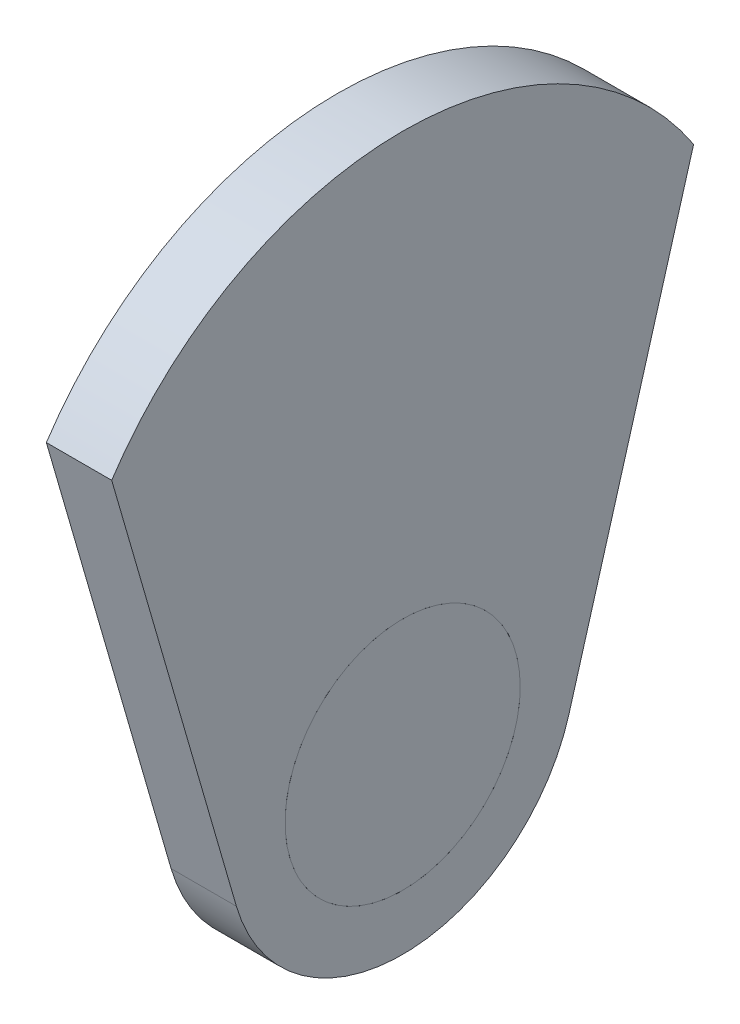
ISO-10303-21;
HEADER;
FILE_DESCRIPTION(('STEP AP214'),'2;1');
FILE_NAME('part.step','',(''),(''),'','','');
FILE_SCHEMA(('AUTOMOTIVE_DESIGN { 1 0 10303 214 1 1 1 1 }'));
ENDSEC;
DATA;
#1=APPLICATION_CONTEXT('core data for automotive mechanical design processes');
#2=APPLICATION_PROTOCOL_DEFINITION('international standard','automotive_design',2000,#1);
#3=PRODUCT_CONTEXT('',#1,'mechanical');
#4=PRODUCT('Part','Part','',(#3));
#5=PRODUCT_RELATED_PRODUCT_CATEGORY('part','',(#4));
#6=PRODUCT_DEFINITION_FORMATION('','',#4);
#7=PRODUCT_DEFINITION_CONTEXT('part definition',#1,'design');
#8=PRODUCT_DEFINITION('design','',#6,#7);
#9=PRODUCT_DEFINITION_SHAPE('','',#8);
#10=(LENGTH_UNIT() NAMED_UNIT(*) SI_UNIT(.MILLI.,.METRE.));
#11=(NAMED_UNIT(*) PLANE_ANGLE_UNIT() SI_UNIT($,.RADIAN.));
#12=(NAMED_UNIT(*) SI_UNIT($,.STERADIAN.) SOLID_ANGLE_UNIT());
#13=UNCERTAINTY_MEASURE_WITH_UNIT(LENGTH_MEASURE(1.E-05),#10,'distance_accuracy_value','');
#14=(GEOMETRIC_REPRESENTATION_CONTEXT(3) GLOBAL_UNCERTAINTY_ASSIGNED_CONTEXT((#13)) GLOBAL_UNIT_ASSIGNED_CONTEXT((#10,
#11,#12)) REPRESENTATION_CONTEXT('',''));
#15=CARTESIAN_POINT('',(0.,0.,0.));
#16=DIRECTION('',(0.,0.,1.));
#17=DIRECTION('',(1.,0.,0.));
#18=AXIS2_PLACEMENT_3D('',#15,#16,#17);
#19=CARTESIAN_POINT('',(15.,0.,0.));
#20=DIRECTION('',(1.,0.,0.));
#21=DIRECTION('',(0.,0.,-1.));
#22=AXIS2_PLACEMENT_3D('',#19,#20,#21);
#23=PLANE('',#22);
#24=CARTESIAN_POINT('',(15.,0.,0.));
#25=DIRECTION('',(1.,0.,0.));
#26=DIRECTION('',(0.,0.,-1.));
#27=AXIS2_PLACEMENT_3D('',#24,#25,#26);
#28=CIRCLE('',#27,27.);
#29=CARTESIAN_POINT('',(15.,6.550179231476,-26.1934181052329));
#30=VERTEX_POINT('',#29);
#31=EDGE_CURVE('E12',#30,#30,#28,.T.);
#32=ORIENTED_EDGE('',*,*,#31,.T.);
#33=EDGE_LOOP('',(#32));
#34=FACE_BOUND('',#33,.T.);
#35=ADVANCED_FACE('F48',(#34),#23,.T.);
#36=CARTESIAN_POINT('',(0.,0.,0.));
#37=DIRECTION('',(1.,0.,0.));
#38=DIRECTION('',(0.,0.,-1.));
#39=AXIS2_PLACEMENT_3D('',#36,#37,#38);
#40=PLANE('',#39);
#41=CARTESIAN_POINT('',(0.,0.,0.));
#42=DIRECTION('',(1.,0.,0.));
#43=DIRECTION('',(0.,0.,-1.));
#44=AXIS2_PLACEMENT_3D('',#41,#42,#43);
#45=CIRCLE('',#44,27.);
#46=CARTESIAN_POINT('',(0.,22.4355320231998,15.0215479507265));
#47=VERTEX_POINT('',#46);
#48=EDGE_CURVE('E54',#47,#47,#45,.T.);
#49=ORIENTED_EDGE('',*,*,#48,.F.);
#50=EDGE_LOOP('',(#49));
#51=FACE_BOUND('',#50,.T.);
#52=ADVANCED_FACE('F63',(#51),#40,.F.);
#53=CARTESIAN_POINT('',(0.,22.4355320231998,15.0215479507265));
#54=CARTESIAN_POINT('',(15.,6.550179231476,-26.1934181052329));
#55=CARTESIAN_POINT('',(0.,-7.60756387825323,59.8926119971261));
#56=CARTESIAN_POINT('',(15.,58.9370154419417,-13.0930596422809));
#57=CARTESIAN_POINT('',(0.,-52.4786279246528,29.8495160956731));
#58=CARTESIAN_POINT('',(15.,45.8366569789897,39.2937765681848));
#59=CARTESIAN_POINT('',(0.,-22.4355320231998,-15.0215479507265));
#60=CARTESIAN_POINT('',(15.,-6.55017923147599,26.1934181052329));
#61=CARTESIAN_POINT('',(0.,7.6075638782532,-59.8926119971261));
#62=CARTESIAN_POINT('',(15.,-58.9370154419417,13.0930596422809));
#63=CARTESIAN_POINT('',(0.,52.4786279246528,-29.8495160956731));
#64=CARTESIAN_POINT('',(15.,-45.8366569789897,-39.2937765681848));
#65=CARTESIAN_POINT('',(0.,22.4355320231998,15.0215479507265));
#66=CARTESIAN_POINT('',(15.,6.550179231476,-26.1934181052329));
#67=(BOUNDED_SURFACE() B_SPLINE_SURFACE(3,1,((#53,#54),(#55,#56),(#57,#58),(#59,#60),(#61,#62),
(#63,#64),(#65,#66)),.UNSPECIFIED.,.T.,.F.,.F.) B_SPLINE_SURFACE_WITH_KNOTS((4,3,4),(2,2),(0.,
0.5,1.),(0.,1.),.UNSPECIFIED.) GEOMETRIC_REPRESENTATION_ITEM() RATIONAL_B_SPLINE_SURFACE(((1.,
1.),(0.333333333333334,0.333333333333333),(0.333333333333334,0.333333333333333),(1.,1.),
(0.333333333333333,0.333333333333333),(0.333333333333333,0.333333333333333),(1.,1.))) REPRESENTATION_ITEM('') SURFACE());
#68=CARTESIAN_POINT('',(0.,22.4355320231998,15.0215479507265));
#69=CARTESIAN_POINT('',(0.15625,22.270059598286,14.5922253876436));
#70=CARTESIAN_POINT('',(0.3125,22.1045871733722,14.1629028245607));
#71=CARTESIAN_POINT('',(0.625,21.7736423235446,13.3042576983949));
#72=CARTESIAN_POINT('',(0.78125,21.6081698986308,12.874935135312));
#73=CARTESIAN_POINT('',(1.09375,21.2772250488033,12.0162900091462));
#74=CARTESIAN_POINT('',(1.25,21.1117526238895,11.5869674460632));
#75=CARTESIAN_POINT('',(1.5625,20.7808077740619,10.7283223198974));
#76=CARTESIAN_POINT('',(1.71875,20.6153353491481,10.2989997568145));
#77=CARTESIAN_POINT('',(2.03125,20.2843904993205,9.4403546306487));
#78=CARTESIAN_POINT('',(2.1875,20.1189180744067,9.01103206756578));
#79=CARTESIAN_POINT('',(2.5,19.7879732245792,8.15238694139996));
#80=CARTESIAN_POINT('',(2.65625,19.6225007996654,7.72306437831706));
#81=CARTESIAN_POINT('',(2.96875,19.2915559498378,6.86441925215123));
#82=CARTESIAN_POINT('',(3.125,19.126083524924,6.43509668906832));
#83=CARTESIAN_POINT('',(3.4375,18.7951386750964,5.5764515629025));
#84=CARTESIAN_POINT('',(3.59375,18.6296662501826,5.14712899981959));
#85=CARTESIAN_POINT('',(3.90625,18.2987214003551,4.28848387365377));
#86=CARTESIAN_POINT('',(4.0625,18.1332489754413,3.85916131057086));
#87=CARTESIAN_POINT('',(4.375,17.8023041256137,3.00051618440504));
#88=CARTESIAN_POINT('',(4.53125,17.6368317006999,2.57119362132213));
#89=CARTESIAN_POINT('',(4.84375,17.3058868508723,1.71254849515631));
#90=CARTESIAN_POINT('',(5.,17.1404144259585,1.2832259320734));
#91=CARTESIAN_POINT('',(5.3125,16.809469576131,0.42458080590758));
#92=CARTESIAN_POINT('',(5.46875,16.6439971512172,-0.00474175717532954));
#93=CARTESIAN_POINT('',(5.78125,16.3130523013896,-0.86338688334115));
#94=CARTESIAN_POINT('',(5.9375,16.1475798764758,-1.29270944642406));
#95=CARTESIAN_POINT('',(6.25,15.8166350266482,-2.15135457258988));
#96=CARTESIAN_POINT('',(6.40625,15.6511626017344,-2.58067713567279));
#97=CARTESIAN_POINT('',(6.71875,15.3202177519068,-3.43932226183861));
#98=CARTESIAN_POINT('',(6.875,15.1547453269931,-3.86864482492152));
#99=CARTESIAN_POINT('',(7.1875,14.8238004771655,-4.72728995108734));
#100=CARTESIAN_POINT('',(7.34375,14.6583280522517,-5.15661251417025));
#101=CARTESIAN_POINT('',(7.65625,14.3273832024241,-6.01525764033607));
#102=CARTESIAN_POINT('',(7.8125,14.1619107775103,-6.44458020341898));
#103=CARTESIAN_POINT('',(8.125,13.8309659276827,-7.3032253295848));
#104=CARTESIAN_POINT('',(8.28125,13.6654935027689,-7.73254789266771));
#105=CARTESIAN_POINT('',(8.59375,13.3345486529414,-8.59119301883354));
#106=CARTESIAN_POINT('',(8.75,13.1690762280276,-9.02051558191645));
#107=CARTESIAN_POINT('',(9.0625,12.8381313782,-9.87916070808227));
#108=CARTESIAN_POINT('',(9.21875,12.6726589532862,-10.3084832711652));
#109=CARTESIAN_POINT('',(9.53125,12.3417141034586,-11.167128397331));
#110=CARTESIAN_POINT('',(9.6875,12.1762416785448,-11.5964509604139));
#111=CARTESIAN_POINT('',(10.,11.8452968287173,-12.4550960865797));
#112=CARTESIAN_POINT('',(10.15625,11.6798244038035,-12.8844186496626));
#113=CARTESIAN_POINT('',(10.46875,11.3488795539759,-13.7430637758285));
#114=CARTESIAN_POINT('',(10.625,11.1834071290621,-14.1723863389114));
#115=CARTESIAN_POINT('',(10.9375,10.8524622792345,-15.0310314650772));
#116=CARTESIAN_POINT('',(11.09375,10.6869898543207,-15.4603540281601));
#117=CARTESIAN_POINT('',(11.40625,10.3560450044932,-16.3189991543259));
#118=CARTESIAN_POINT('',(11.5625,10.1905725795794,-16.7483217174088));
#119=CARTESIAN_POINT('',(11.875,9.85962772975179,-17.6069668435747));
#120=CARTESIAN_POINT('',(12.03125,9.694155304838,-18.0362894066576));
#121=CARTESIAN_POINT('',(12.34375,9.36321045501042,-18.8949345328234));
#122=CARTESIAN_POINT('',(12.5,9.19773803009663,-19.3242570959063));
#123=CARTESIAN_POINT('',(12.8125,8.86679318026905,-20.1829022220721));
#124=CARTESIAN_POINT('',(12.96875,8.70132075535527,-20.612224785155));
#125=CARTESIAN_POINT('',(13.28125,8.37037590552769,-21.4708699113208));
#126=CARTESIAN_POINT('',(13.4375,8.2049034806139,-21.9001924744038));
#127=CARTESIAN_POINT('',(13.75,7.87395863078632,-22.7588376005696));
#128=CARTESIAN_POINT('',(13.90625,7.70848620587253,-23.1881601636525));
#129=CARTESIAN_POINT('',(14.21875,7.37754135604495,-24.0468052898183));
#130=CARTESIAN_POINT('',(14.375,7.21206893113116,-24.4761278529012));
#131=CARTESIAN_POINT('',(14.6875,6.88112408130358,-25.334772979067));
#132=CARTESIAN_POINT('',(14.84375,6.71565165638979,-25.7640955421499));
#133=CARTESIAN_POINT('',(15.,6.550179231476,-26.1934181052329));
#134=B_SPLINE_CURVE_WITH_KNOTS('',3,(#68,#69,#70,#71,#72,#73,#74,#75,#76,#77,#78,#79,#80,#81,
#82,#83,#84,#85,#86,#87,#88,#89,#90,#91,#92,#93,#94,#95,#96,#97,#98,#99,#100,#101,#102,#103,
#104,#105,#106,#107,#108,#109,#110,#111,#112,#113,#114,#115,#116,#117,#118,#119,#120,#121,#122,
#123,#124,#125,#126,#127,#128,#129,#130,#131,#132,#133),.UNSPECIFIED.,.F.,.F.,(4,2,2,2,2,2,2,2,
2,2,2,2,2,2,2,2,2,2,2,2,2,2,2,2,2,2,2,2,2,2,2,2,4),(0.,1.45774395615635,2.9154879123127,
4.37323186846904,5.8309758246254,7.28871978078174,8.74646373693809,10.2042076930944,
11.6619516492508,13.1196956054071,14.5774395615635,16.0351835177198,17.4929274738762,
18.9506714300325,20.4084153861889,21.8661593423452,23.3239032985016,24.7816472546579,
26.2393912108143,27.6971351669706,29.154879123127,30.6126230792833,32.0703670354397,
33.528110991596,34.9858549477524,36.4435989039087,37.9013428600651,39.3590868162214,
40.8168307723778,42.2745747285341,43.7323186846905,45.1900626408468,46.6478065970032),.UNSPECIFIED.);
#135=EDGE_CURVE('BSEAM60',#47,#30,#134,.T.);
#136=ORIENTED_EDGE('',*,*,#48,.T.);
#137=ORIENTED_EDGE('',*,*,#31,.F.);
#138=ORIENTED_EDGE('',*,*,#135,.T.);
#139=ORIENTED_EDGE('',*,*,#135,.F.);
#140=EDGE_LOOP('',(#136,#138,#137,#139));
#141=FACE_BOUND('',#140,.T.);
#142=ADVANCED_FACE('F60',(#141),#67,.T.);
#143=CLOSED_SHELL('',(#35,#52,#142));
#144=MANIFOLD_SOLID_BREP('B2',#143);
#145=CARTESIAN_POINT('',(15.,-11.0427590457887,-38.1897242860343));
#146=DIRECTION('',(0.,0.277775807976635,0.960645928791106));
#147=DIRECTION('',(0.,-0.960645928791106,0.277775807976635));
#148=AXIS2_PLACEMENT_3D('',#145,#146,#147);
#149=PLANE('',#148);
#150=DIRECTION('',(0.,0.960645928791107,-0.277775807976635));
#151=VECTOR('',#150,1.);
#152=CARTESIAN_POINT('',(0.,-11.0427590457887,-38.1897242860343));
#153=LINE('',#152,#151);
#154=CARTESIAN_POINT('',(0.,-11.0540924497785,-38.1864471728379));
#155=VERTEX_POINT('',#154);
#156=CARTESIAN_POINT('',(0.,87.9838685695557,-66.8237929607116));
#157=VERTEX_POINT('',#156);
#158=EDGE_CURVE('E164',#155,#157,#153,.T.);
#159=ORIENTED_EDGE('',*,*,#158,.T.);
#160=DIRECTION('',(-1.,0.,0.));
#161=VECTOR('',#160,1.);
#162=CARTESIAN_POINT('',(15.,87.9838685695557,-66.8237929607116));
#163=LINE('',#162,#161);
#164=CARTESIAN_POINT('',(15.,87.9838685695557,-66.8237929607116));
#165=VERTEX_POINT('',#164);
#166=EDGE_CURVE('E46',#165,#157,#163,.T.);
#167=ORIENTED_EDGE('',*,*,#166,.F.);
#168=DIRECTION('',(0.,0.960645928791107,-0.277775807976635));
#169=VECTOR('',#168,1.);
#170=CARTESIAN_POINT('',(15.,-11.0427590457887,-38.1897242860343));
#171=LINE('',#170,#169);
#172=CARTESIAN_POINT('',(15.,-11.0540924497785,-38.1864471728379));
#173=VERTEX_POINT('',#172);
#174=EDGE_CURVE('E146',#173,#165,#171,.T.);
#175=ORIENTED_EDGE('',*,*,#174,.F.);
#176=DIRECTION('',(-1.,0.,0.));
#177=VECTOR('',#176,1.);
#178=CARTESIAN_POINT('',(15.,-11.0540924497785,-38.1864471728379));
#179=LINE('',#178,#177);
#180=EDGE_CURVE('E157',#173,#155,#179,.T.);
#181=ORIENTED_EDGE('',*,*,#180,.T.);
#182=EDGE_LOOP('',(#159,#167,#175,#181));
#183=FACE_BOUND('',#182,.T.);
#184=ADVANCED_FACE('F98',(#183),#149,.F.);
#185=CARTESIAN_POINT('',(15.,44.,0.));
#186=DIRECTION('',(-1.,0.,0.));
#187=DIRECTION('',(0.,0.,1.));
#188=AXIS2_PLACEMENT_3D('',#185,#186,#187);
#189=CYLINDRICAL_SURFACE('',#188,80.);
#190=CARTESIAN_POINT('',(0.,44.,0.));
#191=DIRECTION('',(1.,0.,0.));
#192=DIRECTION('',(0.,0.,-1.));
#193=AXIS2_PLACEMENT_3D('',#190,#191,#192);
#194=CIRCLE('',#193,80.);
#195=CARTESIAN_POINT('',(0.,87.9838685695557,66.8237929607116));
#196=VERTEX_POINT('',#195);
#197=EDGE_CURVE('E151',#157,#196,#194,.T.);
#198=ORIENTED_EDGE('',*,*,#197,.T.);
#199=DIRECTION('',(-1.,0.,0.));
#200=VECTOR('',#199,1.);
#201=CARTESIAN_POINT('',(15.,87.9838685695557,66.8237929607116));
#202=LINE('',#201,#200);
#203=CARTESIAN_POINT('',(15.,87.9838685695557,66.8237929607116));
#204=VERTEX_POINT('',#203);
#205=EDGE_CURVE('E107',#204,#196,#202,.T.);
#206=ORIENTED_EDGE('',*,*,#205,.F.);
#207=CARTESIAN_POINT('',(15.,44.,0.));
#208=DIRECTION('',(1.,0.,0.));
#209=DIRECTION('',(0.,0.,-1.));
#210=AXIS2_PLACEMENT_3D('',#207,#208,#209);
#211=CIRCLE('',#210,80.);
#212=EDGE_CURVE('E141',#165,#204,#211,.T.);
#213=ORIENTED_EDGE('',*,*,#212,.F.);
#214=ORIENTED_EDGE('',*,*,#166,.T.);
#215=EDGE_LOOP('',(#198,#206,#213,#214));
#216=FACE_BOUND('',#215,.T.);
#217=ADVANCED_FACE('F150',(#216),#189,.T.);
#218=CARTESIAN_POINT('',(15.,-11.0427590457887,38.1897242860343));
#219=DIRECTION('',(0.,-0.277775807976635,0.960645928791106));
#220=DIRECTION('',(0.,-0.960645928791106,-0.277775807976635));
#221=AXIS2_PLACEMENT_3D('',#218,#219,#220);
#222=PLANE('',#221);
#223=DIRECTION('',(0.,0.960645928791107,0.277775807976635));
#224=VECTOR('',#223,1.);
#225=CARTESIAN_POINT('',(0.,-11.0427590457887,38.1897242860343));
#226=LINE('',#225,#224);
#227=CARTESIAN_POINT('',(0.,-11.0686527101332,38.1822369972017));
#228=VERTEX_POINT('',#227);
#229=EDGE_CURVE('E168',#228,#196,#226,.T.);
#230=ORIENTED_EDGE('',*,*,#229,.F.);
#231=DIRECTION('',(-1.,0.,0.));
#232=VECTOR('',#231,1.);
#233=CARTESIAN_POINT('',(15.,-11.0686527101332,38.1822369972017));
#234=LINE('',#233,#232);
#235=CARTESIAN_POINT('',(15.,-11.0686527101332,38.1822369972017));
#236=VERTEX_POINT('',#235);
#237=EDGE_CURVE('E131',#236,#228,#234,.T.);
#238=ORIENTED_EDGE('',*,*,#237,.F.);
#239=DIRECTION('',(0.,0.960645928791107,0.277775807976635));
#240=VECTOR('',#239,1.);
#241=CARTESIAN_POINT('',(15.,-11.0427590457887,38.1897242860343));
#242=LINE('',#241,#240);
#243=EDGE_CURVE('E144',#236,#204,#242,.T.);
#244=ORIENTED_EDGE('',*,*,#243,.T.);
#245=ORIENTED_EDGE('',*,*,#205,.T.);
#246=EDGE_LOOP('',(#230,#238,#244,#245));
#247=FACE_BOUND('',#246,.T.);
#248=ADVANCED_FACE('F155',(#247),#222,.T.);
#249=CARTESIAN_POINT('',(15.,0.,0.));
#250=DIRECTION('',(-1.,0.,0.));
#251=DIRECTION('',(0.,0.,1.));
#252=AXIS2_PLACEMENT_3D('',#249,#250,#251);
#253=CYLINDRICAL_SURFACE('',#252,27.);
#254=CARTESIAN_POINT('',(15.,0.,0.));
#255=DIRECTION('',(1.,0.,0.));
#256=DIRECTION('',(0.,0.,-1.));
#257=AXIS2_PLACEMENT_3D('',#254,#255,#256);
#258=CIRCLE('',#257,27.);
#259=CARTESIAN_POINT('',(15.,0.,-27.));
#260=VERTEX_POINT('',#259);
#261=EDGE_CURVE('E171',#260,#260,#258,.T.);
#262=ORIENTED_EDGE('',*,*,#261,.T.);
#263=EDGE_LOOP('',(#262));
#264=FACE_BOUND('',#263,.T.);
#265=CARTESIAN_POINT('',(0.,0.,0.));
#266=DIRECTION('',(1.,0.,0.));
#267=DIRECTION('',(0.,0.,-1.));
#268=AXIS2_PLACEMENT_3D('',#265,#266,#267);
#269=CIRCLE('',#268,27.);
#270=CARTESIAN_POINT('',(0.,0.,-27.));
#271=VERTEX_POINT('',#270);
#272=EDGE_CURVE('E161',#271,#271,#269,.T.);
#273=ORIENTED_EDGE('',*,*,#272,.F.);
#274=EDGE_LOOP('',(#273));
#275=FACE_BOUND('',#274,.T.);
#276=ADVANCED_FACE('F100',(#264,#275),#253,.F.);
#277=CARTESIAN_POINT('',(15.,0.,0.));
#278=DIRECTION('',(-1.,0.,0.));
#279=DIRECTION('',(0.,0.,1.));
#280=AXIS2_PLACEMENT_3D('',#277,#278,#279);
#281=CYLINDRICAL_SURFACE('',#280,39.754214473269);
#282=CARTESIAN_POINT('',(0.,0.,0.));
#283=DIRECTION('',(1.,0.,0.));
#284=DIRECTION('',(0.,0.,-1.));
#285=AXIS2_PLACEMENT_3D('',#282,#283,#284);
#286=CIRCLE('',#285,39.754214473269);
#287=EDGE_CURVE('E134',#228,#155,#286,.T.);
#288=ORIENTED_EDGE('',*,*,#287,.T.);
#289=ORIENTED_EDGE('',*,*,#180,.F.);
#290=CARTESIAN_POINT('',(15.,0.,0.));
#291=DIRECTION('',(1.,0.,0.));
#292=DIRECTION('',(0.,0.,-1.));
#293=AXIS2_PLACEMENT_3D('',#290,#291,#292);
#294=CIRCLE('',#293,39.754214473269);
#295=EDGE_CURVE('E115',#236,#173,#294,.T.);
#296=ORIENTED_EDGE('',*,*,#295,.F.);
#297=ORIENTED_EDGE('',*,*,#237,.T.);
#298=EDGE_LOOP('',(#288,#289,#296,#297));
#299=FACE_BOUND('',#298,.T.);
#300=ADVANCED_FACE('F183',(#299),#281,.T.);
#301=CARTESIAN_POINT('',(15.,0.,0.));
#302=DIRECTION('',(1.,0.,0.));
#303=DIRECTION('',(0.,0.,-1.));
#304=AXIS2_PLACEMENT_3D('',#301,#302,#303);
#305=PLANE('',#304);
#306=ORIENTED_EDGE('',*,*,#261,.F.);
#307=EDGE_LOOP('',(#306));
#308=FACE_BOUND('',#307,.T.);
#309=ORIENTED_EDGE('',*,*,#174,.T.);
#310=ORIENTED_EDGE('',*,*,#212,.T.);
#311=ORIENTED_EDGE('',*,*,#243,.F.);
#312=ORIENTED_EDGE('',*,*,#295,.T.);
#313=EDGE_LOOP('',(#309,#310,#311,#312));
#314=FACE_BOUND('',#313,.T.);
#315=ADVANCED_FACE('F142',(#308,#314),#305,.T.);
#316=CARTESIAN_POINT('',(0.,0.,0.));
#317=DIRECTION('',(1.,0.,0.));
#318=DIRECTION('',(0.,0.,-1.));
#319=AXIS2_PLACEMENT_3D('',#316,#317,#318);
#320=PLANE('',#319);
#321=ORIENTED_EDGE('',*,*,#272,.T.);
#322=EDGE_LOOP('',(#321));
#323=FACE_BOUND('',#322,.T.);
#324=ORIENTED_EDGE('',*,*,#158,.F.);
#325=ORIENTED_EDGE('',*,*,#287,.F.);
#326=ORIENTED_EDGE('',*,*,#229,.T.);
#327=ORIENTED_EDGE('',*,*,#197,.F.);
#328=EDGE_LOOP('',(#324,#325,#326,#327));
#329=FACE_BOUND('',#328,.T.);
#330=ADVANCED_FACE('F176',(#323,#329),#320,.F.);
#331=CLOSED_SHELL('',(#184,#217,#248,#276,#300,#315,#330));
#332=MANIFOLD_SOLID_BREP('B7',#331);
#333=ADVANCED_BREP_SHAPE_REPRESENTATION('',(#18,#144,#332),#14);
#334=SHAPE_DEFINITION_REPRESENTATION(#9,#333);
ENDSEC;
END-ISO-10303-21;
